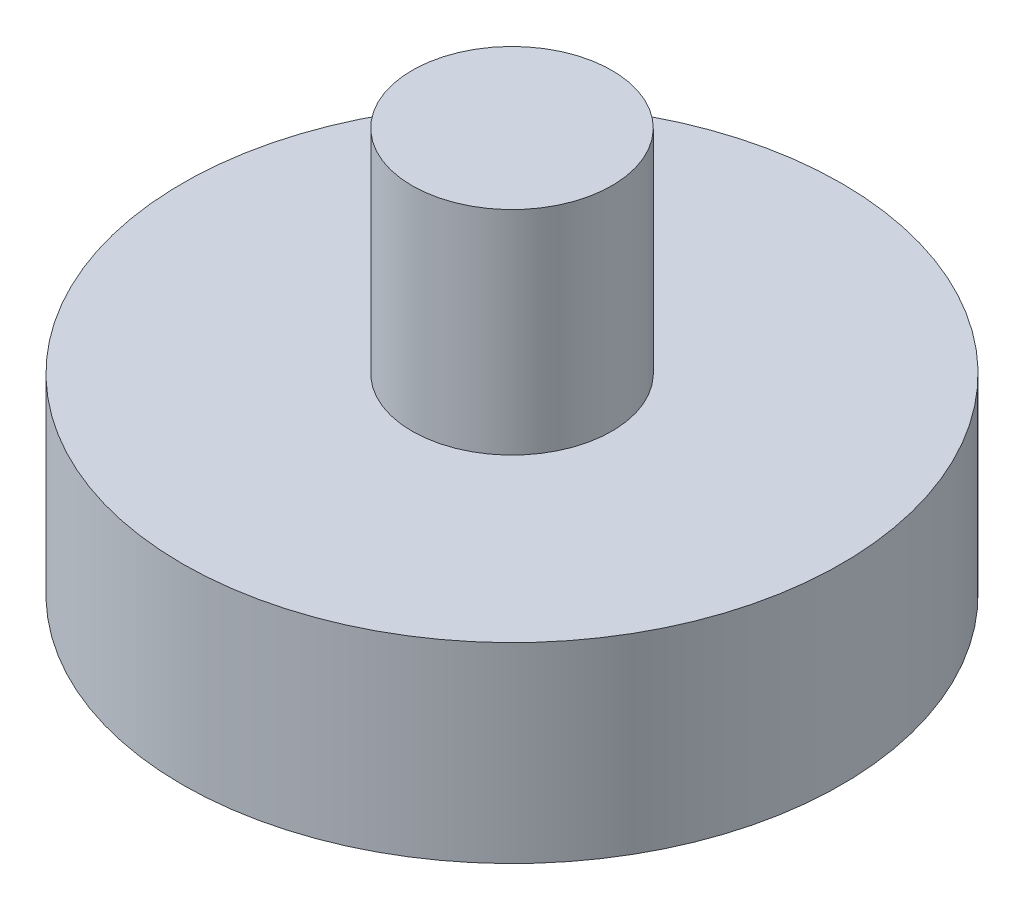
ISO-10303-21;
HEADER;
FILE_DESCRIPTION(('STEP AP214'),'2;1');
FILE_NAME('part.step','',(''),(''),'','','');
FILE_SCHEMA(('AUTOMOTIVE_DESIGN { 1 0 10303 214 1 1 1 1 }'));
ENDSEC;
DATA;
#1=APPLICATION_CONTEXT('core data for automotive mechanical design processes');
#2=APPLICATION_PROTOCOL_DEFINITION('international standard','automotive_design',2000,#1);
#3=PRODUCT_CONTEXT('',#1,'mechanical');
#4=PRODUCT('Part','Part','',(#3));
#5=PRODUCT_RELATED_PRODUCT_CATEGORY('part','',(#4));
#6=PRODUCT_DEFINITION_FORMATION('','',#4);
#7=PRODUCT_DEFINITION_CONTEXT('part definition',#1,'design');
#8=PRODUCT_DEFINITION('design','',#6,#7);
#9=PRODUCT_DEFINITION_SHAPE('','',#8);
#10=(LENGTH_UNIT() NAMED_UNIT(*) SI_UNIT(.MILLI.,.METRE.));
#11=(NAMED_UNIT(*) PLANE_ANGLE_UNIT() SI_UNIT($,.RADIAN.));
#12=(NAMED_UNIT(*) SI_UNIT($,.STERADIAN.) SOLID_ANGLE_UNIT());
#13=UNCERTAINTY_MEASURE_WITH_UNIT(LENGTH_MEASURE(1.E-05),#10,'distance_accuracy_value','');
#14=(GEOMETRIC_REPRESENTATION_CONTEXT(3) GLOBAL_UNCERTAINTY_ASSIGNED_CONTEXT((#13)) GLOBAL_UNIT_ASSIGNED_CONTEXT((#10,
#11,#12)) REPRESENTATION_CONTEXT('',''));
#15=CARTESIAN_POINT('',(0.,0.,0.));
#16=DIRECTION('',(0.,0.,1.));
#17=DIRECTION('',(1.,0.,0.));
#18=AXIS2_PLACEMENT_3D('',#15,#16,#17);
#19=CARTESIAN_POINT('',(0.,4.5,0.));
#20=DIRECTION('',(0.,-1.,0.));
#21=DIRECTION('',(0.,0.,-1.));
#22=AXIS2_PLACEMENT_3D('',#19,#20,#21);
#23=CYLINDRICAL_SURFACE('',#22,7.75);
#24=CARTESIAN_POINT('',(0.,4.5,0.));
#25=DIRECTION('',(0.,1.,0.));
#26=DIRECTION('',(0.,0.,1.));
#27=AXIS2_PLACEMENT_3D('',#24,#25,#26);
#28=CIRCLE('',#27,7.75);
#29=CARTESIAN_POINT('',(0.,4.5,7.75));
#30=VERTEX_POINT('',#29);
#31=EDGE_CURVE('E41',#30,#30,#28,.T.);
#32=ORIENTED_EDGE('',*,*,#31,.F.);
#33=EDGE_LOOP('',(#32));
#34=FACE_BOUND('',#33,.T.);
#35=CARTESIAN_POINT('',(0.,0.,0.));
#36=DIRECTION('',(0.,1.,0.));
#37=DIRECTION('',(0.,0.,1.));
#38=AXIS2_PLACEMENT_3D('',#35,#36,#37);
#39=CIRCLE('',#38,7.75);
#40=CARTESIAN_POINT('',(0.,0.,7.75));
#41=VERTEX_POINT('',#40);
#42=EDGE_CURVE('E37',#41,#41,#39,.T.);
#43=ORIENTED_EDGE('',*,*,#42,.T.);
#44=EDGE_LOOP('',(#43));
#45=FACE_BOUND('',#44,.T.);
#46=ADVANCED_FACE('F34',(#34,#45),#23,.T.);
#47=CARTESIAN_POINT('',(0.,4.5,0.));
#48=DIRECTION('',(0.,1.,0.));
#49=DIRECTION('',(0.,0.,1.));
#50=AXIS2_PLACEMENT_3D('',#47,#48,#49);
#51=PLANE('',#50);
#52=CARTESIAN_POINT('',(0.,4.5,0.));
#53=DIRECTION('',(0.,1.,0.));
#54=DIRECTION('',(0.,0.,1.));
#55=AXIS2_PLACEMENT_3D('',#52,#53,#54);
#56=CIRCLE('',#55,2.35);
#57=CARTESIAN_POINT('',(0.,4.5,2.35));
#58=VERTEX_POINT('',#57);
#59=EDGE_CURVE('E10',#58,#58,#56,.T.);
#60=ORIENTED_EDGE('',*,*,#59,.F.);
#61=EDGE_LOOP('',(#60));
#62=FACE_BOUND('',#61,.T.);
#63=ORIENTED_EDGE('',*,*,#31,.T.);
#64=EDGE_LOOP('',(#63));
#65=FACE_BOUND('',#64,.T.);
#66=ADVANCED_FACE('F70',(#62,#65),#51,.T.);
#67=CARTESIAN_POINT('',(0.,0.,0.));
#68=DIRECTION('',(0.,1.,0.));
#69=DIRECTION('',(0.,0.,1.));
#70=AXIS2_PLACEMENT_3D('',#67,#68,#69);
#71=PLANE('',#70);
#72=CARTESIAN_POINT('',(0.,0.,0.));
#73=DIRECTION('',(0.,-1.,0.));
#74=DIRECTION('',(0.,0.,-1.));
#75=AXIS2_PLACEMENT_3D('',#72,#73,#74);
#76=CIRCLE('',#75,3.1);
#77=CARTESIAN_POINT('',(0.,0.,-3.1));
#78=VERTEX_POINT('',#77);
#79=EDGE_CURVE('E51',#78,#78,#76,.T.);
#80=ORIENTED_EDGE('',*,*,#79,.F.);
#81=EDGE_LOOP('',(#80));
#82=FACE_BOUND('',#81,.T.);
#83=ORIENTED_EDGE('',*,*,#42,.F.);
#84=EDGE_LOOP('',(#83));
#85=FACE_BOUND('',#84,.T.);
#86=ADVANCED_FACE('F66',(#82,#85),#71,.F.);
#87=CARTESIAN_POINT('',(0.,9.5,0.));
#88=DIRECTION('',(0.,-1.,0.));
#89=DIRECTION('',(0.,0.,-1.));
#90=AXIS2_PLACEMENT_3D('',#87,#88,#89);
#91=CYLINDRICAL_SURFACE('',#90,2.35);
#92=CARTESIAN_POINT('',(0.,9.5,0.));
#93=DIRECTION('',(0.,1.,0.));
#94=DIRECTION('',(0.,0.,1.));
#95=AXIS2_PLACEMENT_3D('',#92,#93,#94);
#96=CIRCLE('',#95,2.35);
#97=CARTESIAN_POINT('',(0.,9.5,2.35));
#98=VERTEX_POINT('',#97);
#99=EDGE_CURVE('E47',#98,#98,#96,.T.);
#100=ORIENTED_EDGE('',*,*,#99,.F.);
#101=EDGE_LOOP('',(#100));
#102=FACE_BOUND('',#101,.T.);
#103=ORIENTED_EDGE('',*,*,#59,.T.);
#104=EDGE_LOOP('',(#103));
#105=FACE_BOUND('',#104,.T.);
#106=ADVANCED_FACE('F69',(#102,#105),#91,.T.);
#107=CARTESIAN_POINT('',(0.,9.5,0.));
#108=DIRECTION('',(0.,1.,0.));
#109=DIRECTION('',(0.,0.,1.));
#110=AXIS2_PLACEMENT_3D('',#107,#108,#109);
#111=PLANE('',#110);
#112=ORIENTED_EDGE('',*,*,#99,.T.);
#113=EDGE_LOOP('',(#112));
#114=FACE_BOUND('',#113,.T.);
#115=ADVANCED_FACE('F62',(#114),#111,.T.);
#116=CARTESIAN_POINT('',(0.,3.5,0.));
#117=DIRECTION('',(0.,-1.,0.));
#118=DIRECTION('',(0.,0.,-1.));
#119=AXIS2_PLACEMENT_3D('',#116,#117,#118);
#120=CYLINDRICAL_SURFACE('',#119,3.1);
#121=CARTESIAN_POINT('',(0.,3.5,0.));
#122=DIRECTION('',(0.,-1.,0.));
#123=DIRECTION('',(0.,0.,-1.));
#124=AXIS2_PLACEMENT_3D('',#121,#122,#123);
#125=CIRCLE('',#124,3.1);
#126=CARTESIAN_POINT('',(0.,3.5,-3.1));
#127=VERTEX_POINT('',#126);
#128=EDGE_CURVE('E50',#127,#127,#125,.T.);
#129=ORIENTED_EDGE('',*,*,#128,.F.);
#130=EDGE_LOOP('',(#129));
#131=FACE_BOUND('',#130,.T.);
#132=ORIENTED_EDGE('',*,*,#79,.T.);
#133=EDGE_LOOP('',(#132));
#134=FACE_BOUND('',#133,.T.);
#135=ADVANCED_FACE('F59',(#131,#134),#120,.F.);
#136=CARTESIAN_POINT('',(0.,3.5,0.));
#137=DIRECTION('',(0.,-1.,0.));
#138=DIRECTION('',(0.,0.,-1.));
#139=AXIS2_PLACEMENT_3D('',#136,#137,#138);
#140=PLANE('',#139);
#141=ORIENTED_EDGE('',*,*,#128,.T.);
#142=EDGE_LOOP('',(#141));
#143=FACE_BOUND('',#142,.T.);
#144=ADVANCED_FACE('F57',(#143),#140,.T.);
#145=CLOSED_SHELL('',(#46,#66,#86,#106,#115,#135,#144));
#146=MANIFOLD_SOLID_BREP('B2',#145);
#147=ADVANCED_BREP_SHAPE_REPRESENTATION('',(#18,#146),#14);
#148=SHAPE_DEFINITION_REPRESENTATION(#9,#147);
ENDSEC;
END-ISO-10303-21;
